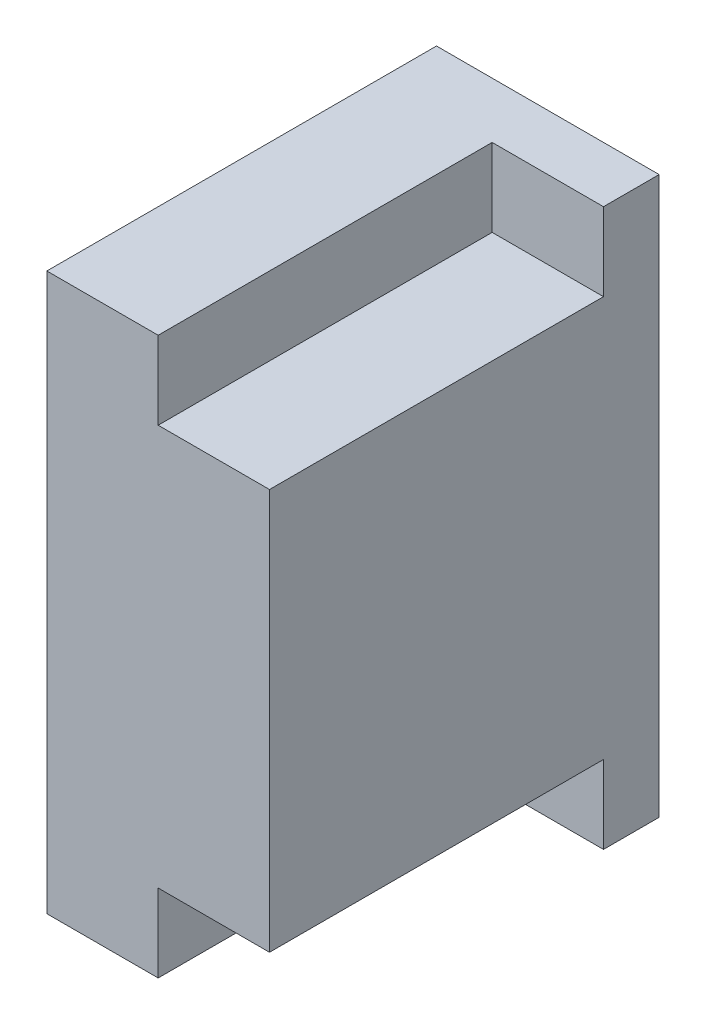
ISO-10303-21;
HEADER;
FILE_DESCRIPTION(('STEP AP214'),'2;1');
FILE_NAME('part.step','',(''),(''),'','','');
FILE_SCHEMA(('AUTOMOTIVE_DESIGN { 1 0 10303 214 1 1 1 1 }'));
ENDSEC;
DATA;
#1=APPLICATION_CONTEXT('core data for automotive mechanical design processes');
#2=APPLICATION_PROTOCOL_DEFINITION('international standard','automotive_design',2000,#1);
#3=PRODUCT_CONTEXT('',#1,'mechanical');
#4=PRODUCT('Part','Part','',(#3));
#5=PRODUCT_RELATED_PRODUCT_CATEGORY('part','',(#4));
#6=PRODUCT_DEFINITION_FORMATION('','',#4);
#7=PRODUCT_DEFINITION_CONTEXT('part definition',#1,'design');
#8=PRODUCT_DEFINITION('design','',#6,#7);
#9=PRODUCT_DEFINITION_SHAPE('','',#8);
#10=(LENGTH_UNIT() NAMED_UNIT(*) SI_UNIT(.MILLI.,.METRE.));
#11=(NAMED_UNIT(*) PLANE_ANGLE_UNIT() SI_UNIT($,.RADIAN.));
#12=(NAMED_UNIT(*) SI_UNIT($,.STERADIAN.) SOLID_ANGLE_UNIT());
#13=UNCERTAINTY_MEASURE_WITH_UNIT(LENGTH_MEASURE(1.E-05),#10,'distance_accuracy_value','');
#14=(GEOMETRIC_REPRESENTATION_CONTEXT(3) GLOBAL_UNCERTAINTY_ASSIGNED_CONTEXT((#13)) GLOBAL_UNIT_ASSIGNED_CONTEXT((#10,
#11,#12)) REPRESENTATION_CONTEXT('',''));
#15=CARTESIAN_POINT('',(0.,0.,0.));
#16=DIRECTION('',(0.,0.,1.));
#17=DIRECTION('',(1.,0.,0.));
#18=AXIS2_PLACEMENT_3D('',#15,#16,#17);
#19=CARTESIAN_POINT('',(-0.5,-0.25,0.));
#20=DIRECTION('',(1.,0.,0.));
#21=DIRECTION('',(0.,0.,1.));
#22=AXIS2_PLACEMENT_3D('',#19,#20,#21);
#23=PLANE('',#22);
#24=DIRECTION('',(0.,1.,0.));
#25=VECTOR('',#24,1.);
#26=CARTESIAN_POINT('',(-0.5,-0.25,0.35));
#27=LINE('',#26,#25);
#28=CARTESIAN_POINT('',(-0.5,-0.25,0.35));
#29=VERTEX_POINT('',#28);
#30=CARTESIAN_POINT('',(-0.5,0.25,0.35));
#31=VERTEX_POINT('',#30);
#32=EDGE_CURVE('E11',#29,#31,#27,.T.);
#33=ORIENTED_EDGE('',*,*,#32,.T.);
#34=DIRECTION('',(0.,0.,1.));
#35=VECTOR('',#34,1.);
#36=CARTESIAN_POINT('',(-0.5,0.25,0.));
#37=LINE('',#36,#35);
#38=CARTESIAN_POINT('',(-0.5,0.25,0.));
#39=VERTEX_POINT('',#38);
#40=EDGE_CURVE('E24',#39,#31,#37,.T.);
#41=ORIENTED_EDGE('',*,*,#40,.F.);
#42=DIRECTION('',(0.,1.,0.));
#43=VECTOR('',#42,1.);
#44=CARTESIAN_POINT('',(-0.5,-0.25,0.));
#45=LINE('',#44,#43);
#46=CARTESIAN_POINT('',(-0.5,-0.25,0.));
#47=VERTEX_POINT('',#46);
#48=EDGE_CURVE('E173',#47,#39,#45,.T.);
#49=ORIENTED_EDGE('',*,*,#48,.F.);
#50=DIRECTION('',(0.,0.,1.));
#51=VECTOR('',#50,1.);
#52=CARTESIAN_POINT('',(-0.5,-0.25,0.));
#53=LINE('',#52,#51);
#54=EDGE_CURVE('E36',#47,#29,#53,.T.);
#55=ORIENTED_EDGE('',*,*,#54,.T.);
#56=EDGE_LOOP('',(#33,#41,#49,#55));
#57=FACE_BOUND('',#56,.T.);
#58=ADVANCED_FACE('F17',(#57),#23,.F.);
#59=CARTESIAN_POINT('',(-0.5,-0.25,0.));
#60=DIRECTION('',(0.,1.,0.));
#61=DIRECTION('',(0.,0.,1.));
#62=AXIS2_PLACEMENT_3D('',#59,#60,#61);
#63=PLANE('',#62);
#64=DIRECTION('',(1.,0.,0.));
#65=VECTOR('',#64,1.);
#66=CARTESIAN_POINT('',(-0.4,-0.25,0.05));
#67=LINE('',#66,#65);
#68=CARTESIAN_POINT('',(-0.4,-0.25,0.05));
#69=VERTEX_POINT('',#68);
#70=CARTESIAN_POINT('',(-0.3,-0.25,0.05));
#71=VERTEX_POINT('',#70);
#72=EDGE_CURVE('E169',#69,#71,#67,.T.);
#73=ORIENTED_EDGE('',*,*,#72,.F.);
#74=DIRECTION('',(0.,0.,1.));
#75=VECTOR('',#74,1.);
#76=CARTESIAN_POINT('',(-0.4,-0.25,0.05));
#77=LINE('',#76,#75);
#78=CARTESIAN_POINT('',(-0.4,-0.25,0.35));
#79=VERTEX_POINT('',#78);
#80=EDGE_CURVE('E166',#69,#79,#77,.T.);
#81=ORIENTED_EDGE('',*,*,#80,.T.);
#82=DIRECTION('',(1.,0.,0.));
#83=VECTOR('',#82,1.);
#84=CARTESIAN_POINT('',(-0.5,-0.25,0.35));
#85=LINE('',#84,#83);
#86=EDGE_CURVE('E164',#29,#79,#85,.T.);
#87=ORIENTED_EDGE('',*,*,#86,.F.);
#88=ORIENTED_EDGE('',*,*,#54,.F.);
#89=DIRECTION('',(1.,0.,0.));
#90=VECTOR('',#89,1.);
#91=CARTESIAN_POINT('',(-0.5,-0.25,0.));
#92=LINE('',#91,#90);
#93=CARTESIAN_POINT('',(-0.3,-0.25,0.));
#94=VERTEX_POINT('',#93);
#95=EDGE_CURVE('E161',#47,#94,#92,.T.);
#96=ORIENTED_EDGE('',*,*,#95,.T.);
#97=DIRECTION('',(0.,0.,1.));
#98=VECTOR('',#97,1.);
#99=CARTESIAN_POINT('',(-0.3,-0.25,0.));
#100=LINE('',#99,#98);
#101=EDGE_CURVE('E159',#94,#71,#100,.T.);
#102=ORIENTED_EDGE('',*,*,#101,.T.);
#103=EDGE_LOOP('',(#73,#81,#87,#88,#96,#102));
#104=FACE_BOUND('',#103,.T.);
#105=ADVANCED_FACE('F185',(#104),#63,.F.);
#106=CARTESIAN_POINT('',(-0.5,-0.25,0.35));
#107=DIRECTION('',(0.,0.,1.));
#108=DIRECTION('',(1.,0.,0.));
#109=AXIS2_PLACEMENT_3D('',#106,#107,#108);
#110=PLANE('',#109);
#111=DIRECTION('',(1.,0.,0.));
#112=VECTOR('',#111,1.);
#113=CARTESIAN_POINT('',(-0.5,0.25,0.35));
#114=LINE('',#113,#112);
#115=CARTESIAN_POINT('',(-0.4,0.25,0.35));
#116=VERTEX_POINT('',#115);
#117=EDGE_CURVE('E157',#31,#116,#114,.T.);
#118=ORIENTED_EDGE('',*,*,#117,.F.);
#119=ORIENTED_EDGE('',*,*,#32,.F.);
#120=ORIENTED_EDGE('',*,*,#86,.T.);
#121=DIRECTION('',(0.,1.,0.));
#122=VECTOR('',#121,1.);
#123=CARTESIAN_POINT('',(-0.4,-0.25,0.35));
#124=LINE('',#123,#122);
#125=CARTESIAN_POINT('',(-0.4,-0.18,0.35));
#126=VERTEX_POINT('',#125);
#127=EDGE_CURVE('E155',#79,#126,#124,.T.);
#128=ORIENTED_EDGE('',*,*,#127,.T.);
#129=DIRECTION('',(1.,0.,0.));
#130=VECTOR('',#129,1.);
#131=CARTESIAN_POINT('',(-0.4,-0.18,0.35));
#132=LINE('',#131,#130);
#133=CARTESIAN_POINT('',(-0.3,-0.18,0.35));
#134=VERTEX_POINT('',#133);
#135=EDGE_CURVE('E153',#126,#134,#132,.T.);
#136=ORIENTED_EDGE('',*,*,#135,.T.);
#137=DIRECTION('',(0.,1.,0.));
#138=VECTOR('',#137,1.);
#139=CARTESIAN_POINT('',(-0.3,-0.25,0.35));
#140=LINE('',#139,#138);
#141=CARTESIAN_POINT('',(-0.3,0.18,0.35));
#142=VERTEX_POINT('',#141);
#143=EDGE_CURVE('E151',#134,#142,#140,.T.);
#144=ORIENTED_EDGE('',*,*,#143,.T.);
#145=DIRECTION('',(1.,0.,0.));
#146=VECTOR('',#145,1.);
#147=CARTESIAN_POINT('',(-0.4,0.18,0.35));
#148=LINE('',#147,#146);
#149=CARTESIAN_POINT('',(-0.4,0.18,0.35));
#150=VERTEX_POINT('',#149);
#151=EDGE_CURVE('E149',#150,#142,#148,.T.);
#152=ORIENTED_EDGE('',*,*,#151,.F.);
#153=DIRECTION('',(0.,1.,0.));
#154=VECTOR('',#153,1.);
#155=CARTESIAN_POINT('',(-0.4,0.18,0.35));
#156=LINE('',#155,#154);
#157=EDGE_CURVE('E99',#150,#116,#156,.T.);
#158=ORIENTED_EDGE('',*,*,#157,.T.);
#159=EDGE_LOOP('',(#118,#119,#120,#128,#136,#144,#152,#158));
#160=FACE_BOUND('',#159,.T.);
#161=ADVANCED_FACE('F189',(#160),#110,.T.);
#162=CARTESIAN_POINT('',(-0.5,0.25,0.));
#163=DIRECTION('',(0.,1.,0.));
#164=DIRECTION('',(0.,0.,1.));
#165=AXIS2_PLACEMENT_3D('',#162,#163,#164);
#166=PLANE('',#165);
#167=DIRECTION('',(0.,0.,1.));
#168=VECTOR('',#167,1.);
#169=CARTESIAN_POINT('',(-0.3,0.25,0.));
#170=LINE('',#169,#168);
#171=CARTESIAN_POINT('',(-0.3,0.25,0.));
#172=VERTEX_POINT('',#171);
#173=CARTESIAN_POINT('',(-0.3,0.25,0.05));
#174=VERTEX_POINT('',#173);
#175=EDGE_CURVE('E146',#172,#174,#170,.T.);
#176=ORIENTED_EDGE('',*,*,#175,.F.);
#177=DIRECTION('',(1.,0.,0.));
#178=VECTOR('',#177,1.);
#179=CARTESIAN_POINT('',(-0.5,0.25,0.));
#180=LINE('',#179,#178);
#181=EDGE_CURVE('E143',#39,#172,#180,.T.);
#182=ORIENTED_EDGE('',*,*,#181,.F.);
#183=ORIENTED_EDGE('',*,*,#40,.T.);
#184=ORIENTED_EDGE('',*,*,#117,.T.);
#185=DIRECTION('',(0.,0.,1.));
#186=VECTOR('',#185,1.);
#187=CARTESIAN_POINT('',(-0.4,0.25,0.05));
#188=LINE('',#187,#186);
#189=CARTESIAN_POINT('',(-0.4,0.25,0.05));
#190=VERTEX_POINT('',#189);
#191=EDGE_CURVE('E141',#190,#116,#188,.T.);
#192=ORIENTED_EDGE('',*,*,#191,.F.);
#193=DIRECTION('',(1.,0.,0.));
#194=VECTOR('',#193,1.);
#195=CARTESIAN_POINT('',(-0.4,0.25,0.05));
#196=LINE('',#195,#194);
#197=EDGE_CURVE('E112',#190,#174,#196,.T.);
#198=ORIENTED_EDGE('',*,*,#197,.T.);
#199=EDGE_LOOP('',(#176,#182,#183,#184,#192,#198));
#200=FACE_BOUND('',#199,.T.);
#201=ADVANCED_FACE('F179',(#200),#166,.T.);
#202=CARTESIAN_POINT('',(-0.5,-0.25,0.));
#203=DIRECTION('',(0.,0.,1.));
#204=DIRECTION('',(1.,0.,0.));
#205=AXIS2_PLACEMENT_3D('',#202,#203,#204);
#206=PLANE('',#205);
#207=ORIENTED_EDGE('',*,*,#181,.T.);
#208=DIRECTION('',(0.,1.,0.));
#209=VECTOR('',#208,1.);
#210=CARTESIAN_POINT('',(-0.3,-0.25,0.));
#211=LINE('',#210,#209);
#212=EDGE_CURVE('E137',#94,#172,#211,.T.);
#213=ORIENTED_EDGE('',*,*,#212,.F.);
#214=ORIENTED_EDGE('',*,*,#95,.F.);
#215=ORIENTED_EDGE('',*,*,#48,.T.);
#216=EDGE_LOOP('',(#207,#213,#214,#215));
#217=FACE_BOUND('',#216,.T.);
#218=ADVANCED_FACE('F176',(#217),#206,.F.);
#219=CARTESIAN_POINT('',(-0.3,-0.25,0.));
#220=DIRECTION('',(1.,0.,0.));
#221=DIRECTION('',(0.,0.,1.));
#222=AXIS2_PLACEMENT_3D('',#219,#220,#221);
#223=PLANE('',#222);
#224=ORIENTED_EDGE('',*,*,#101,.F.);
#225=ORIENTED_EDGE('',*,*,#212,.T.);
#226=ORIENTED_EDGE('',*,*,#175,.T.);
#227=DIRECTION('',(0.,-1.,0.));
#228=VECTOR('',#227,1.);
#229=CARTESIAN_POINT('',(-0.3,-0.035,0.05));
#230=LINE('',#229,#228);
#231=CARTESIAN_POINT('',(-0.3,0.18,0.05));
#232=VERTEX_POINT('',#231);
#233=EDGE_CURVE('E135',#174,#232,#230,.T.);
#234=ORIENTED_EDGE('',*,*,#233,.T.);
#235=DIRECTION('',(0.,0.,1.));
#236=VECTOR('',#235,1.);
#237=CARTESIAN_POINT('',(-0.3,0.18,0.025));
#238=LINE('',#237,#236);
#239=EDGE_CURVE('E117',#232,#142,#238,.T.);
#240=ORIENTED_EDGE('',*,*,#239,.T.);
#241=ORIENTED_EDGE('',*,*,#143,.F.);
#242=DIRECTION('',(0.,0.,1.));
#243=VECTOR('',#242,1.);
#244=CARTESIAN_POINT('',(-0.3,-0.18,0.025));
#245=LINE('',#244,#243);
#246=CARTESIAN_POINT('',(-0.3,-0.18,0.05));
#247=VERTEX_POINT('',#246);
#248=EDGE_CURVE('E131',#247,#134,#245,.T.);
#249=ORIENTED_EDGE('',*,*,#248,.F.);
#250=DIRECTION('',(0.,-1.,0.));
#251=VECTOR('',#250,1.);
#252=CARTESIAN_POINT('',(-0.3,-0.25,0.05));
#253=LINE('',#252,#251);
#254=EDGE_CURVE('E128',#247,#71,#253,.T.);
#255=ORIENTED_EDGE('',*,*,#254,.T.);
#256=EDGE_LOOP('',(#224,#225,#226,#234,#240,#241,#249,#255));
#257=FACE_BOUND('',#256,.T.);
#258=ADVANCED_FACE('F181',(#257),#223,.T.);
#259=CARTESIAN_POINT('',(-0.4,-0.25,0.05));
#260=DIRECTION('',(0.,0.,1.));
#261=DIRECTION('',(1.,0.,0.));
#262=AXIS2_PLACEMENT_3D('',#259,#260,#261);
#263=PLANE('',#262);
#264=DIRECTION('',(1.,0.,0.));
#265=VECTOR('',#264,1.);
#266=CARTESIAN_POINT('',(-0.4,-0.18,0.05));
#267=LINE('',#266,#265);
#268=CARTESIAN_POINT('',(-0.4,-0.18,0.05));
#269=VERTEX_POINT('',#268);
#270=EDGE_CURVE('E125',#269,#247,#267,.T.);
#271=ORIENTED_EDGE('',*,*,#270,.F.);
#272=DIRECTION('',(0.,1.,0.));
#273=VECTOR('',#272,1.);
#274=CARTESIAN_POINT('',(-0.4,-0.25,0.05));
#275=LINE('',#274,#273);
#276=EDGE_CURVE('E122',#69,#269,#275,.T.);
#277=ORIENTED_EDGE('',*,*,#276,.F.);
#278=ORIENTED_EDGE('',*,*,#72,.T.);
#279=ORIENTED_EDGE('',*,*,#254,.F.);
#280=EDGE_LOOP('',(#271,#277,#278,#279));
#281=FACE_BOUND('',#280,.T.);
#282=ADVANCED_FACE('F197',(#281),#263,.T.);
#283=CARTESIAN_POINT('',(-0.4,-0.25,0.05));
#284=DIRECTION('',(1.,0.,0.));
#285=DIRECTION('',(0.,0.,1.));
#286=AXIS2_PLACEMENT_3D('',#283,#284,#285);
#287=PLANE('',#286);
#288=ORIENTED_EDGE('',*,*,#80,.F.);
#289=ORIENTED_EDGE('',*,*,#276,.T.);
#290=DIRECTION('',(0.,0.,1.));
#291=VECTOR('',#290,1.);
#292=CARTESIAN_POINT('',(-0.4,-0.18,0.05));
#293=LINE('',#292,#291);
#294=EDGE_CURVE('E103',#269,#126,#293,.T.);
#295=ORIENTED_EDGE('',*,*,#294,.T.);
#296=ORIENTED_EDGE('',*,*,#127,.F.);
#297=EDGE_LOOP('',(#288,#289,#295,#296));
#298=FACE_BOUND('',#297,.T.);
#299=ADVANCED_FACE('F199',(#298),#287,.T.);
#300=CARTESIAN_POINT('',(-0.4,0.18,0.05));
#301=DIRECTION('',(1.,0.,0.));
#302=DIRECTION('',(0.,0.,1.));
#303=AXIS2_PLACEMENT_3D('',#300,#301,#302);
#304=PLANE('',#303);
#305=DIRECTION('',(0.,0.,1.));
#306=VECTOR('',#305,1.);
#307=CARTESIAN_POINT('',(-0.4,0.18,0.05));
#308=LINE('',#307,#306);
#309=CARTESIAN_POINT('',(-0.4,0.18,0.05));
#310=VERTEX_POINT('',#309);
#311=EDGE_CURVE('E93',#310,#150,#308,.T.);
#312=ORIENTED_EDGE('',*,*,#311,.F.);
#313=DIRECTION('',(0.,1.,0.));
#314=VECTOR('',#313,1.);
#315=CARTESIAN_POINT('',(-0.4,0.18,0.05));
#316=LINE('',#315,#314);
#317=EDGE_CURVE('E97',#310,#190,#316,.T.);
#318=ORIENTED_EDGE('',*,*,#317,.T.);
#319=ORIENTED_EDGE('',*,*,#191,.T.);
#320=ORIENTED_EDGE('',*,*,#157,.F.);
#321=EDGE_LOOP('',(#312,#318,#319,#320));
#322=FACE_BOUND('',#321,.T.);
#323=ADVANCED_FACE('F95',(#322),#304,.T.);
#324=CARTESIAN_POINT('',(-0.4,0.18,0.05));
#325=DIRECTION('',(0.,1.,0.));
#326=DIRECTION('',(0.,0.,1.));
#327=AXIS2_PLACEMENT_3D('',#324,#325,#326);
#328=PLANE('',#327);
#329=DIRECTION('',(1.,0.,0.));
#330=VECTOR('',#329,1.);
#331=CARTESIAN_POINT('',(-0.4,0.18,0.05));
#332=LINE('',#331,#330);
#333=EDGE_CURVE('E110',#310,#232,#332,.T.);
#334=ORIENTED_EDGE('',*,*,#333,.F.);
#335=ORIENTED_EDGE('',*,*,#311,.T.);
#336=ORIENTED_EDGE('',*,*,#151,.T.);
#337=ORIENTED_EDGE('',*,*,#239,.F.);
#338=EDGE_LOOP('',(#334,#335,#336,#337));
#339=FACE_BOUND('',#338,.T.);
#340=ADVANCED_FACE('F115',(#339),#328,.T.);
#341=CARTESIAN_POINT('',(-0.4,-0.18,0.05));
#342=DIRECTION('',(0.,1.,0.));
#343=DIRECTION('',(0.,0.,1.));
#344=AXIS2_PLACEMENT_3D('',#341,#342,#343);
#345=PLANE('',#344);
#346=ORIENTED_EDGE('',*,*,#248,.T.);
#347=ORIENTED_EDGE('',*,*,#135,.F.);
#348=ORIENTED_EDGE('',*,*,#294,.F.);
#349=ORIENTED_EDGE('',*,*,#270,.T.);
#350=EDGE_LOOP('',(#346,#347,#348,#349));
#351=FACE_BOUND('',#350,.T.);
#352=ADVANCED_FACE('F193',(#351),#345,.F.);
#353=CARTESIAN_POINT('',(-0.4,0.18,0.05));
#354=DIRECTION('',(0.,0.,1.));
#355=DIRECTION('',(1.,0.,0.));
#356=AXIS2_PLACEMENT_3D('',#353,#354,#355);
#357=PLANE('',#356);
#358=ORIENTED_EDGE('',*,*,#197,.F.);
#359=ORIENTED_EDGE('',*,*,#317,.F.);
#360=ORIENTED_EDGE('',*,*,#333,.T.);
#361=ORIENTED_EDGE('',*,*,#233,.F.);
#362=EDGE_LOOP('',(#358,#359,#360,#361));
#363=FACE_BOUND('',#362,.T.);
#364=ADVANCED_FACE('F108',(#363),#357,.T.);
#365=CLOSED_SHELL('',(#58,#105,#161,#201,#218,#258,#282,#299,#323,#340,#352,#364));
#366=MANIFOLD_SOLID_BREP('B1',#365);
#367=ADVANCED_BREP_SHAPE_REPRESENTATION('',(#18,#366),#14);
#368=SHAPE_DEFINITION_REPRESENTATION(#9,#367);
ENDSEC;
END-ISO-10303-21;
